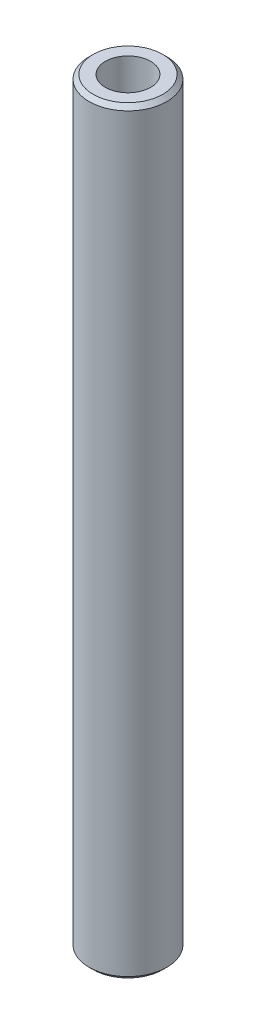
ISO-10303-21;
HEADER;
FILE_DESCRIPTION(('STEP AP214'),'2;1');
FILE_NAME('part.step','',(''),(''),'','','');
FILE_SCHEMA(('AUTOMOTIVE_DESIGN { 1 0 10303 214 1 1 1 1 }'));
ENDSEC;
DATA;
#1=APPLICATION_CONTEXT('core data for automotive mechanical design processes');
#2=APPLICATION_PROTOCOL_DEFINITION('international standard','automotive_design',2000,#1);
#3=PRODUCT_CONTEXT('',#1,'mechanical');
#4=PRODUCT('Part','Part','',(#3));
#5=PRODUCT_RELATED_PRODUCT_CATEGORY('part','',(#4));
#6=PRODUCT_DEFINITION_FORMATION('','',#4);
#7=PRODUCT_DEFINITION_CONTEXT('part definition',#1,'design');
#8=PRODUCT_DEFINITION('design','',#6,#7);
#9=PRODUCT_DEFINITION_SHAPE('','',#8);
#10=(LENGTH_UNIT() NAMED_UNIT(*) SI_UNIT(.MILLI.,.METRE.));
#11=(NAMED_UNIT(*) PLANE_ANGLE_UNIT() SI_UNIT($,.RADIAN.));
#12=(NAMED_UNIT(*) SI_UNIT($,.STERADIAN.) SOLID_ANGLE_UNIT());
#13=UNCERTAINTY_MEASURE_WITH_UNIT(LENGTH_MEASURE(1.E-05),#10,'distance_accuracy_value','');
#14=(GEOMETRIC_REPRESENTATION_CONTEXT(3) GLOBAL_UNCERTAINTY_ASSIGNED_CONTEXT((#13)) GLOBAL_UNIT_ASSIGNED_CONTEXT((#10,
#11,#12)) REPRESENTATION_CONTEXT('',''));
#15=CARTESIAN_POINT('',(0.,0.,0.));
#16=DIRECTION('',(0.,0.,1.));
#17=DIRECTION('',(1.,0.,0.));
#18=AXIS2_PLACEMENT_3D('',#15,#16,#17);
#19=CARTESIAN_POINT('',(0.,194.944000668219,0.));
#20=DIRECTION('',(0.,-1.,0.));
#21=DIRECTION('',(0.,0.,-1.));
#22=AXIS2_PLACEMENT_3D('',#19,#20,#21);
#23=CYLINDRICAL_SURFACE('',#22,10.);
#24=CARTESIAN_POINT('',(0.,193.872262850324,0.));
#25=DIRECTION('',(0.,1.,0.));
#26=DIRECTION('',(0.,0.,1.));
#27=AXIS2_PLACEMENT_3D('',#24,#25,#26);
#28=CIRCLE('',#27,10.);
#29=CARTESIAN_POINT('',(0.,193.872262850324,10.));
#30=VERTEX_POINT('',#29);
#31=EDGE_CURVE('E50',#30,#30,#28,.F.);
#32=ORIENTED_EDGE('',*,*,#31,.T.);
#33=EDGE_LOOP('',(#32));
#34=FACE_BOUND('',#33,.T.);
#35=CARTESIAN_POINT('',(0.,1.07173781789555,0.));
#36=DIRECTION('',(0.,1.,0.));
#37=DIRECTION('',(0.,0.,1.));
#38=AXIS2_PLACEMENT_3D('',#35,#36,#37);
#39=CIRCLE('',#38,10.);
#40=CARTESIAN_POINT('',(0.,1.07173781789555,10.));
#41=VERTEX_POINT('',#40);
#42=EDGE_CURVE('E51',#41,#41,#39,.T.);
#43=ORIENTED_EDGE('',*,*,#42,.T.);
#44=EDGE_LOOP('',(#43));
#45=FACE_BOUND('',#44,.T.);
#46=ADVANCED_FACE('F39',(#34,#45),#23,.T.);
#47=CARTESIAN_POINT('',(0.,194.944000668219,0.));
#48=DIRECTION('',(0.,1.,0.));
#49=DIRECTION('',(0.,0.,1.));
#50=AXIS2_PLACEMENT_3D('',#47,#48,#49);
#51=PLANE('',#50);
#52=CARTESIAN_POINT('',(0.,194.944000668219,0.));
#53=DIRECTION('',(0.,1.,0.));
#54=DIRECTION('',(0.,0.,1.));
#55=AXIS2_PLACEMENT_3D('',#52,#53,#54);
#56=CIRCLE('',#55,8.92826218210452);
#57=CARTESIAN_POINT('',(0.,194.944000668219,8.92826218210452));
#58=VERTEX_POINT('',#57);
#59=EDGE_CURVE('E54',#58,#58,#56,.T.);
#60=ORIENTED_EDGE('',*,*,#59,.T.);
#61=EDGE_LOOP('',(#60));
#62=FACE_BOUND('',#61,.T.);
#63=CARTESIAN_POINT('',(0.,194.944000668219,0.));
#64=DIRECTION('',(0.,1.,0.));
#65=DIRECTION('',(0.,0.,1.));
#66=AXIS2_PLACEMENT_3D('',#63,#64,#65);
#67=CIRCLE('',#66,5.81355551176854);
#68=CARTESIAN_POINT('',(0.,194.944000668219,5.81355551176854));
#69=VERTEX_POINT('',#68);
#70=EDGE_CURVE('E58',#69,#69,#67,.T.);
#71=ORIENTED_EDGE('',*,*,#70,.F.);
#72=EDGE_LOOP('',(#71));
#73=FACE_BOUND('',#72,.T.);
#74=ADVANCED_FACE('F69',(#62,#73),#51,.T.);
#75=CARTESIAN_POINT('',(0.,0.,0.));
#76=DIRECTION('',(0.,1.,0.));
#77=DIRECTION('',(0.,0.,1.));
#78=AXIS2_PLACEMENT_3D('',#75,#76,#77);
#79=PLANE('',#78);
#80=CARTESIAN_POINT('',(0.,0.,0.));
#81=DIRECTION('',(0.,1.,0.));
#82=DIRECTION('',(0.,0.,1.));
#83=AXIS2_PLACEMENT_3D('',#80,#81,#82);
#84=CIRCLE('',#83,8.92826218210446);
#85=CARTESIAN_POINT('',(0.,0.,8.92826218210446));
#86=VERTEX_POINT('',#85);
#87=EDGE_CURVE('E10',#86,#86,#84,.F.);
#88=ORIENTED_EDGE('',*,*,#87,.T.);
#89=EDGE_LOOP('',(#88));
#90=FACE_BOUND('',#89,.T.);
#91=CARTESIAN_POINT('',(0.,0.,0.));
#92=DIRECTION('',(0.,1.,0.));
#93=DIRECTION('',(0.,0.,1.));
#94=AXIS2_PLACEMENT_3D('',#91,#92,#93);
#95=CIRCLE('',#94,5.81355551176854);
#96=CARTESIAN_POINT('',(0.,0.,5.81355551176854));
#97=VERTEX_POINT('',#96);
#98=EDGE_CURVE('E63',#97,#97,#95,.T.);
#99=ORIENTED_EDGE('',*,*,#98,.T.);
#100=EDGE_LOOP('',(#99));
#101=FACE_BOUND('',#100,.T.);
#102=ADVANCED_FACE('F75',(#90,#101),#79,.F.);
#103=CARTESIAN_POINT('',(0.,194.944000668219,0.));
#104=DIRECTION('',(0.,-1.,0.));
#105=DIRECTION('',(0.,0.,-1.));
#106=AXIS2_PLACEMENT_3D('',#103,#104,#105);
#107=CYLINDRICAL_SURFACE('',#106,5.81355551176854);
#108=ORIENTED_EDGE('',*,*,#70,.T.);
#109=EDGE_LOOP('',(#108));
#110=FACE_BOUND('',#109,.T.);
#111=ORIENTED_EDGE('',*,*,#98,.F.);
#112=EDGE_LOOP('',(#111));
#113=FACE_BOUND('',#112,.T.);
#114=ADVANCED_FACE('F70',(#110,#113),#107,.F.);
#115=CARTESIAN_POINT('',(0.,194.944000668219,0.));
#116=DIRECTION('',(0.,-1.,0.));
#117=DIRECTION('',(0.,0.,-1.));
#118=AXIS2_PLACEMENT_3D('',#115,#116,#117);
#119=CONICAL_SURFACE('',#118,8.92826218210452,0.785398163397457);
#120=ORIENTED_EDGE('',*,*,#31,.F.);
#121=EDGE_LOOP('',(#120));
#122=FACE_BOUND('',#121,.T.);
#123=ORIENTED_EDGE('',*,*,#59,.F.);
#124=EDGE_LOOP('',(#123));
#125=FACE_BOUND('',#124,.T.);
#126=ADVANCED_FACE('F81',(#122,#125),#119,.T.);
#127=CARTESIAN_POINT('',(0.,1.07173781789555,0.));
#128=DIRECTION('',(0.,1.,0.));
#129=DIRECTION('',(0.,0.,1.));
#130=AXIS2_PLACEMENT_3D('',#127,#128,#129);
#131=CONICAL_SURFACE('',#130,10.,0.785398163397444);
#132=ORIENTED_EDGE('',*,*,#87,.F.);
#133=EDGE_LOOP('',(#132));
#134=FACE_BOUND('',#133,.T.);
#135=ORIENTED_EDGE('',*,*,#42,.F.);
#136=EDGE_LOOP('',(#135));
#137=FACE_BOUND('',#136,.T.);
#138=ADVANCED_FACE('F45',(#134,#137),#131,.T.);
#139=CLOSED_SHELL('',(#46,#74,#102,#114,#126,#138));
#140=MANIFOLD_SOLID_BREP('B2',#139);
#141=ADVANCED_BREP_SHAPE_REPRESENTATION('',(#18,#140),#14);
#142=SHAPE_DEFINITION_REPRESENTATION(#9,#141);
ENDSEC;
END-ISO-10303-21;
